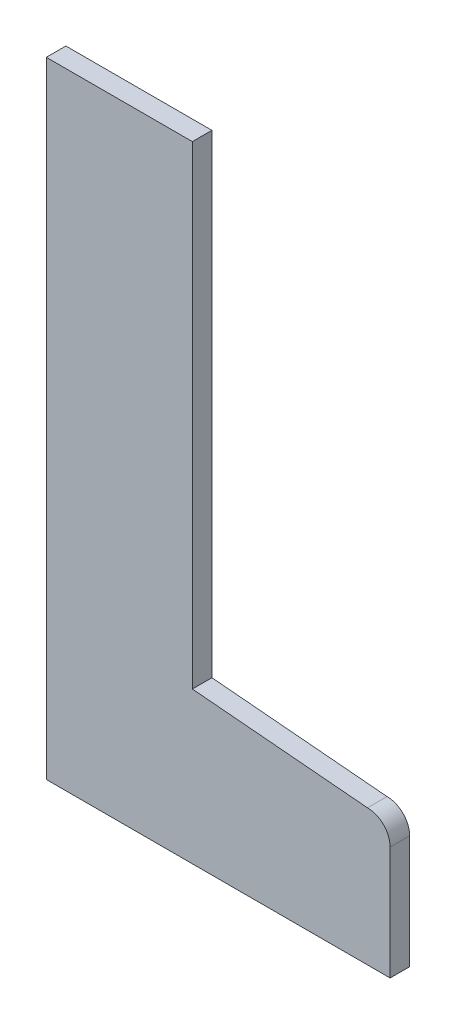
ISO-10303-21;
HEADER;
FILE_DESCRIPTION(('STEP AP214'),'2;1');
FILE_NAME('part.step','',(''),(''),'','','');
FILE_SCHEMA(('AUTOMOTIVE_DESIGN { 1 0 10303 214 1 1 1 1 }'));
ENDSEC;
DATA;
#1=APPLICATION_CONTEXT('core data for automotive mechanical design processes');
#2=APPLICATION_PROTOCOL_DEFINITION('international standard','automotive_design',2000,#1);
#3=PRODUCT_CONTEXT('',#1,'mechanical');
#4=PRODUCT('Part','Part','',(#3));
#5=PRODUCT_RELATED_PRODUCT_CATEGORY('part','',(#4));
#6=PRODUCT_DEFINITION_FORMATION('','',#4);
#7=PRODUCT_DEFINITION_CONTEXT('part definition',#1,'design');
#8=PRODUCT_DEFINITION('design','',#6,#7);
#9=PRODUCT_DEFINITION_SHAPE('','',#8);
#10=(LENGTH_UNIT() NAMED_UNIT(*) SI_UNIT(.MILLI.,.METRE.));
#11=(NAMED_UNIT(*) PLANE_ANGLE_UNIT() SI_UNIT($,.RADIAN.));
#12=(NAMED_UNIT(*) SI_UNIT($,.STERADIAN.) SOLID_ANGLE_UNIT());
#13=UNCERTAINTY_MEASURE_WITH_UNIT(LENGTH_MEASURE(1.E-05),#10,'distance_accuracy_value','');
#14=(GEOMETRIC_REPRESENTATION_CONTEXT(3) GLOBAL_UNCERTAINTY_ASSIGNED_CONTEXT((#13)) GLOBAL_UNIT_ASSIGNED_CONTEXT((#10,
#11,#12)) REPRESENTATION_CONTEXT('',''));
#15=CARTESIAN_POINT('',(0.,0.,0.));
#16=DIRECTION('',(0.,0.,1.));
#17=DIRECTION('',(1.,0.,0.));
#18=AXIS2_PLACEMENT_3D('',#15,#16,#17);
#19=CARTESIAN_POINT('',(141.422179453836,-74.8032573548353,11.90625));
#20=DIRECTION('',(0.,1.,0.));
#21=DIRECTION('',(-1.,0.,0.));
#22=AXIS2_PLACEMENT_3D('',#19,#20,#21);
#23=PLANE('',#22);
#24=DIRECTION('',(1.,0.,0.));
#25=VECTOR('',#24,1.);
#26=CARTESIAN_POINT('',(-101.285966724172,-74.8032573548353,11.90625));
#27=LINE('',#26,#25);
#28=CARTESIAN_POINT('',(-68.0119667241719,-74.8032573548353,11.90625));
#29=VERTEX_POINT('',#28);
#30=CARTESIAN_POINT('',(141.422179453836,-74.8032573548353,11.90625));
#31=VERTEX_POINT('',#30);
#32=EDGE_CURVE('E86',#29,#31,#27,.T.);
#33=ORIENTED_EDGE('',*,*,#32,.F.);
#34=DIRECTION('',(0.,0.,1.));
#35=VECTOR('',#34,1.);
#36=CARTESIAN_POINT('',(-68.0119667241719,-74.8032573548353,0.));
#37=LINE('',#36,#35);
#38=CARTESIAN_POINT('',(-68.0119667241719,-74.8032573548353,0.));
#39=VERTEX_POINT('',#38);
#40=EDGE_CURVE('E151',#39,#29,#37,.T.);
#41=ORIENTED_EDGE('',*,*,#40,.F.);
#42=DIRECTION('',(1.,0.,0.));
#43=VECTOR('',#42,1.);
#44=CARTESIAN_POINT('',(141.422179453836,-74.8032573548353,0.));
#45=LINE('',#44,#43);
#46=CARTESIAN_POINT('',(141.422179453836,-74.8032573548353,0.));
#47=VERTEX_POINT('',#46);
#48=EDGE_CURVE('E125',#39,#47,#45,.T.);
#49=ORIENTED_EDGE('',*,*,#48,.T.);
#50=DIRECTION('',(0.,0.,-1.));
#51=VECTOR('',#50,1.);
#52=CARTESIAN_POINT('',(141.422179453836,-74.8032573548353,11.90625));
#53=LINE('',#52,#51);
#54=EDGE_CURVE('E11',#31,#47,#53,.T.);
#55=ORIENTED_EDGE('',*,*,#54,.F.);
#56=EDGE_LOOP('',(#33,#41,#49,#55));
#57=FACE_BOUND('',#56,.T.);
#58=ADVANCED_FACE('F32',(#57),#23,.F.);
#59=CARTESIAN_POINT('',(141.422179453836,-74.8032573548353,11.90625));
#60=DIRECTION('',(-1.,0.,0.));
#61=DIRECTION('',(0.,0.,1.));
#62=AXIS2_PLACEMENT_3D('',#59,#60,#61);
#63=PLANE('',#62);
#64=DIRECTION('',(0.,1.,0.));
#65=VECTOR('',#64,1.);
#66=CARTESIAN_POINT('',(141.422179453836,-74.8032573548353,0.));
#67=LINE('',#66,#65);
#68=CARTESIAN_POINT('',(141.422179453836,-5.72537224715956,0.));
#69=VERTEX_POINT('',#68);
#70=EDGE_CURVE('E127',#47,#69,#67,.T.);
#71=ORIENTED_EDGE('',*,*,#70,.T.);
#72=DIRECTION('',(0.,0.,-1.));
#73=VECTOR('',#72,1.);
#74=CARTESIAN_POINT('',(141.422179453836,-5.72537224715956,11.90625));
#75=LINE('',#74,#73);
#76=CARTESIAN_POINT('',(141.422179453836,-5.72537224715956,11.90625));
#77=VERTEX_POINT('',#76);
#78=EDGE_CURVE('E39',#77,#69,#75,.T.);
#79=ORIENTED_EDGE('',*,*,#78,.F.);
#80=DIRECTION('',(0.,1.,0.));
#81=VECTOR('',#80,1.);
#82=CARTESIAN_POINT('',(141.422179453836,-74.8032573548353,11.90625));
#83=LINE('',#82,#81);
#84=EDGE_CURVE('E101',#31,#77,#83,.T.);
#85=ORIENTED_EDGE('',*,*,#84,.F.);
#86=ORIENTED_EDGE('',*,*,#54,.T.);
#87=EDGE_LOOP('',(#71,#79,#85,#86));
#88=FACE_BOUND('',#87,.T.);
#89=ADVANCED_FACE('F160',(#88),#63,.F.);
#90=CARTESIAN_POINT('',(127.61642521393,-5.72537224715956,11.90625));
#91=DIRECTION('',(0.,0.,-1.));
#92=DIRECTION('',(-1.,0.,0.));
#93=AXIS2_PLACEMENT_3D('',#90,#91,#92);
#94=CYLINDRICAL_SURFACE('',#93,13.8057542399065);
#95=CARTESIAN_POINT('',(127.61642521393,-5.72537224715956,0.));
#96=DIRECTION('',(0.,0.,1.));
#97=DIRECTION('',(1.,0.,0.));
#98=AXIS2_PLACEMENT_3D('',#95,#96,#97);
#99=CIRCLE('',#98,13.8057542399065);
#100=CARTESIAN_POINT('',(127.61642521393,8.08038199274699,0.));
#101=VERTEX_POINT('',#100);
#102=EDGE_CURVE('E110',#69,#101,#99,.T.);
#103=ORIENTED_EDGE('',*,*,#102,.T.);
#104=DIRECTION('',(0.,0.,-1.));
#105=VECTOR('',#104,1.);
#106=CARTESIAN_POINT('',(127.61642521393,8.08038199274699,11.90625));
#107=LINE('',#106,#105);
#108=CARTESIAN_POINT('',(127.61642521393,8.08038199274699,11.90625));
#109=VERTEX_POINT('',#108);
#110=EDGE_CURVE('E107',#109,#101,#107,.T.);
#111=ORIENTED_EDGE('',*,*,#110,.F.);
#112=CARTESIAN_POINT('',(127.61642521393,-5.72537224715956,11.90625));
#113=DIRECTION('',(0.,0.,1.));
#114=DIRECTION('',(1.,0.,0.));
#115=AXIS2_PLACEMENT_3D('',#112,#113,#114);
#116=CIRCLE('',#115,13.8057542399065);
#117=EDGE_CURVE('E94',#77,#109,#116,.T.);
#118=ORIENTED_EDGE('',*,*,#117,.F.);
#119=ORIENTED_EDGE('',*,*,#78,.T.);
#120=EDGE_LOOP('',(#103,#111,#118,#119));
#121=FACE_BOUND('',#120,.T.);
#122=ADVANCED_FACE('F108',(#121),#94,.T.);
#123=CARTESIAN_POINT('',(127.61642521393,8.08038199274699,11.90625));
#124=DIRECTION('',(-0.0871557427476513,-0.996194698091746,0.));
#125=DIRECTION('',(0.996194698091746,-0.0871557427476513,0.));
#126=AXIS2_PLACEMENT_3D('',#123,#124,#125);
#127=PLANE('',#126);
#128=DIRECTION('',(-0.996194698091746,0.0871557427476513,0.));
#129=VECTOR('',#128,1.);
#130=CARTESIAN_POINT('',(127.61642521393,8.08038199274699,0.));
#131=LINE('',#130,#129);
#132=CARTESIAN_POINT('',(20.9438538219921,17.4130226987006,0.));
#133=VERTEX_POINT('',#132);
#134=EDGE_CURVE('E130',#101,#133,#131,.T.);
#135=ORIENTED_EDGE('',*,*,#134,.T.);
#136=DIRECTION('',(0.,0.,-1.));
#137=VECTOR('',#136,1.);
#138=CARTESIAN_POINT('',(20.9438538219921,17.4130226987006,11.90625));
#139=LINE('',#138,#137);
#140=CARTESIAN_POINT('',(20.9438538219921,17.4130226987006,11.90625));
#141=VERTEX_POINT('',#140);
#142=EDGE_CURVE('E114',#141,#133,#139,.T.);
#143=ORIENTED_EDGE('',*,*,#142,.F.);
#144=DIRECTION('',(-0.996194698091746,0.0871557427476513,0.));
#145=VECTOR('',#144,1.);
#146=CARTESIAN_POINT('',(127.61642521393,8.08038199274699,11.90625));
#147=LINE('',#146,#145);
#148=EDGE_CURVE('E98',#109,#141,#147,.T.);
#149=ORIENTED_EDGE('',*,*,#148,.F.);
#150=ORIENTED_EDGE('',*,*,#110,.T.);
#151=EDGE_LOOP('',(#135,#143,#149,#150));
#152=FACE_BOUND('',#151,.T.);
#153=ADVANCED_FACE('F116',(#152),#127,.F.);
#154=CARTESIAN_POINT('',(20.943853821992,111.886742645165,11.90625));
#155=DIRECTION('',(-1.,0.,0.));
#156=DIRECTION('',(0.,-1.,0.));
#157=AXIS2_PLACEMENT_3D('',#154,#155,#156);
#158=PLANE('',#157);
#159=DIRECTION('',(0.,1.,0.));
#160=VECTOR('',#159,1.);
#161=CARTESIAN_POINT('',(20.943853821992,111.886742645165,0.));
#162=LINE('',#161,#160);
#163=CARTESIAN_POINT('',(20.943853821992,306.196742645165,0.));
#164=VERTEX_POINT('',#163);
#165=EDGE_CURVE('E132',#133,#164,#162,.T.);
#166=ORIENTED_EDGE('',*,*,#165,.T.);
#167=DIRECTION('',(0.,0.,-1.));
#168=VECTOR('',#167,1.);
#169=CARTESIAN_POINT('',(20.943853821992,306.196742645165,11.90625));
#170=LINE('',#169,#168);
#171=CARTESIAN_POINT('',(20.943853821992,306.196742645165,11.90625));
#172=VERTEX_POINT('',#171);
#173=EDGE_CURVE('E124',#172,#164,#170,.T.);
#174=ORIENTED_EDGE('',*,*,#173,.F.);
#175=DIRECTION('',(0.,1.,0.));
#176=VECTOR('',#175,1.);
#177=CARTESIAN_POINT('',(20.9438538219921,34.4953341590868,11.90625));
#178=LINE('',#177,#176);
#179=EDGE_CURVE('E55',#141,#172,#178,.T.);
#180=ORIENTED_EDGE('',*,*,#179,.F.);
#181=ORIENTED_EDGE('',*,*,#142,.T.);
#182=EDGE_LOOP('',(#166,#174,#180,#181));
#183=FACE_BOUND('',#182,.T.);
#184=ADVANCED_FACE('F142',(#183),#158,.F.);
#185=CARTESIAN_POINT('',(-101.285966724172,306.196742645165,11.90625));
#186=DIRECTION('',(0.,-1.,0.));
#187=DIRECTION('',(1.,0.,0.));
#188=AXIS2_PLACEMENT_3D('',#185,#186,#187);
#189=PLANE('',#188);
#190=DIRECTION('',(-1.,0.,0.));
#191=VECTOR('',#190,1.);
#192=CARTESIAN_POINT('',(-101.285966724172,306.196742645165,0.));
#193=LINE('',#192,#191);
#194=CARTESIAN_POINT('',(-68.0119667241719,306.196742645165,0.));
#195=VERTEX_POINT('',#194);
#196=EDGE_CURVE('E78',#164,#195,#193,.T.);
#197=ORIENTED_EDGE('',*,*,#196,.T.);
#198=DIRECTION('',(0.,0.,1.));
#199=VECTOR('',#198,1.);
#200=CARTESIAN_POINT('',(-68.0119667241719,306.196742645165,0.));
#201=LINE('',#200,#199);
#202=CARTESIAN_POINT('',(-68.0119667241719,306.196742645165,11.90625));
#203=VERTEX_POINT('',#202);
#204=EDGE_CURVE('E46',#195,#203,#201,.T.);
#205=ORIENTED_EDGE('',*,*,#204,.T.);
#206=DIRECTION('',(-1.,0.,0.));
#207=VECTOR('',#206,1.);
#208=CARTESIAN_POINT('',(20.943853821992,306.196742645165,11.90625));
#209=LINE('',#208,#207);
#210=EDGE_CURVE('E119',#172,#203,#209,.T.);
#211=ORIENTED_EDGE('',*,*,#210,.F.);
#212=ORIENTED_EDGE('',*,*,#173,.T.);
#213=EDGE_LOOP('',(#197,#205,#211,#212));
#214=FACE_BOUND('',#213,.T.);
#215=ADVANCED_FACE('F145',(#214),#189,.F.);
#216=CARTESIAN_POINT('',(127.61642521393,-5.72537224715956,11.90625));
#217=DIRECTION('',(0.,0.,1.));
#218=DIRECTION('',(1.,0.,0.));
#219=AXIS2_PLACEMENT_3D('',#216,#217,#218);
#220=PLANE('',#219);
#221=DIRECTION('',(0.,1.,0.));
#222=VECTOR('',#221,1.);
#223=CARTESIAN_POINT('',(-68.0119667241719,-74.8032573548353,11.90625));
#224=LINE('',#223,#222);
#225=EDGE_CURVE('E147',#29,#203,#224,.T.);
#226=ORIENTED_EDGE('',*,*,#225,.F.);
#227=ORIENTED_EDGE('',*,*,#32,.T.);
#228=ORIENTED_EDGE('',*,*,#84,.T.);
#229=ORIENTED_EDGE('',*,*,#117,.T.);
#230=ORIENTED_EDGE('',*,*,#148,.T.);
#231=ORIENTED_EDGE('',*,*,#179,.T.);
#232=ORIENTED_EDGE('',*,*,#210,.T.);
#233=EDGE_LOOP('',(#226,#227,#228,#229,#230,#231,#232));
#234=FACE_BOUND('',#233,.T.);
#235=ADVANCED_FACE('F96',(#234),#220,.T.);
#236=CARTESIAN_POINT('',(127.61642521393,-5.72537224715956,0.));
#237=DIRECTION('',(0.,0.,1.));
#238=DIRECTION('',(1.,0.,0.));
#239=AXIS2_PLACEMENT_3D('',#236,#237,#238);
#240=PLANE('',#239);
#241=ORIENTED_EDGE('',*,*,#48,.F.);
#242=DIRECTION('',(0.,1.,0.));
#243=VECTOR('',#242,1.);
#244=CARTESIAN_POINT('',(-68.0119667241719,-74.8032573548353,0.));
#245=LINE('',#244,#243);
#246=EDGE_CURVE('E153',#39,#195,#245,.T.);
#247=ORIENTED_EDGE('',*,*,#246,.T.);
#248=ORIENTED_EDGE('',*,*,#196,.F.);
#249=ORIENTED_EDGE('',*,*,#165,.F.);
#250=ORIENTED_EDGE('',*,*,#134,.F.);
#251=ORIENTED_EDGE('',*,*,#102,.F.);
#252=ORIENTED_EDGE('',*,*,#70,.F.);
#253=EDGE_LOOP('',(#241,#247,#248,#249,#250,#251,#252));
#254=FACE_BOUND('',#253,.T.);
#255=ADVANCED_FACE('F140',(#254),#240,.F.);
#256=CARTESIAN_POINT('',(-68.0119667241719,-74.8032573548353,0.));
#257=DIRECTION('',(1.,0.,0.));
#258=DIRECTION('',(0.,0.,-1.));
#259=AXIS2_PLACEMENT_3D('',#256,#257,#258);
#260=PLANE('',#259);
#261=ORIENTED_EDGE('',*,*,#225,.T.);
#262=ORIENTED_EDGE('',*,*,#204,.F.);
#263=ORIENTED_EDGE('',*,*,#246,.F.);
#264=ORIENTED_EDGE('',*,*,#40,.T.);
#265=EDGE_LOOP('',(#261,#262,#263,#264));
#266=FACE_BOUND('',#265,.T.);
#267=ADVANCED_FACE('F152',(#266),#260,.F.);
#268=CLOSED_SHELL('',(#58,#89,#122,#153,#184,#215,#235,#255,#267));
#269=MANIFOLD_SOLID_BREP('B2',#268);
#270=ADVANCED_BREP_SHAPE_REPRESENTATION('',(#18,#269),#14);
#271=SHAPE_DEFINITION_REPRESENTATION(#9,#270);
ENDSEC;
END-ISO-10303-21;
